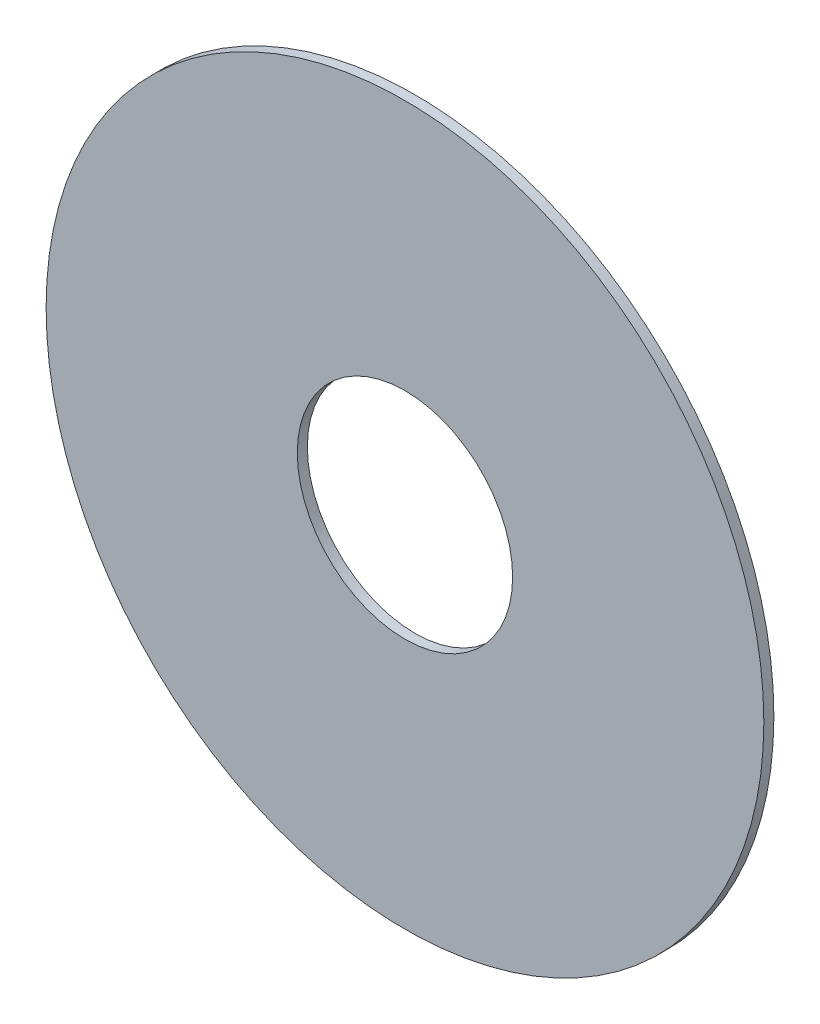
ISO-10303-21;
HEADER;
FILE_DESCRIPTION(('STEP AP214'),'2;1');
FILE_NAME('part.step','',(''),(''),'','','');
FILE_SCHEMA(('AUTOMOTIVE_DESIGN { 1 0 10303 214 1 1 1 1 }'));
ENDSEC;
DATA;
#1=APPLICATION_CONTEXT('core data for automotive mechanical design processes');
#2=APPLICATION_PROTOCOL_DEFINITION('international standard','automotive_design',2000,#1);
#3=PRODUCT_CONTEXT('',#1,'mechanical');
#4=PRODUCT('Part','Part','',(#3));
#5=PRODUCT_RELATED_PRODUCT_CATEGORY('part','',(#4));
#6=PRODUCT_DEFINITION_FORMATION('','',#4);
#7=PRODUCT_DEFINITION_CONTEXT('part definition',#1,'design');
#8=PRODUCT_DEFINITION('design','',#6,#7);
#9=PRODUCT_DEFINITION_SHAPE('','',#8);
#10=(LENGTH_UNIT() NAMED_UNIT(*) SI_UNIT(.MILLI.,.METRE.));
#11=(NAMED_UNIT(*) PLANE_ANGLE_UNIT() SI_UNIT($,.RADIAN.));
#12=(NAMED_UNIT(*) SI_UNIT($,.STERADIAN.) SOLID_ANGLE_UNIT());
#13=UNCERTAINTY_MEASURE_WITH_UNIT(LENGTH_MEASURE(1.E-05),#10,'distance_accuracy_value','');
#14=(GEOMETRIC_REPRESENTATION_CONTEXT(3) GLOBAL_UNCERTAINTY_ASSIGNED_CONTEXT((#13)) GLOBAL_UNIT_ASSIGNED_CONTEXT((#10,
#11,#12)) REPRESENTATION_CONTEXT('',''));
#15=CARTESIAN_POINT('',(0.,0.,0.));
#16=DIRECTION('',(0.,0.,1.));
#17=DIRECTION('',(1.,0.,0.));
#18=AXIS2_PLACEMENT_3D('',#15,#16,#17);
#19=CARTESIAN_POINT('',(170.18,-110.236,-0.045));
#20=DIRECTION('',(0.,0.,-1.));
#21=DIRECTION('',(0.,-1.,0.));
#22=AXIS2_PLACEMENT_3D('',#19,#20,#21);
#23=CYLINDRICAL_SURFACE('',#22,0.375);
#24=CARTESIAN_POINT('',(170.18,-110.236,-0.035));
#25=DIRECTION('',(0.,0.,-1.));
#26=DIRECTION('',(0.,-1.,0.));
#27=AXIS2_PLACEMENT_3D('',#24,#25,#26);
#28=CIRCLE('',#27,0.375);
#29=CARTESIAN_POINT('',(170.18,-110.611,-0.035));
#30=VERTEX_POINT('',#29);
#31=EDGE_CURVE('E25',#30,#30,#28,.T.);
#32=ORIENTED_EDGE('',*,*,#31,.T.);
#33=DIRECTION('',(0.,0.,1.));
#34=VECTOR('',#33,1.);
#35=CARTESIAN_POINT('',(170.18,-110.611,-0.045));
#36=LINE('',#35,#34);
#37=CARTESIAN_POINT('',(170.18,-110.611,0.));
#38=VERTEX_POINT('',#37);
#39=EDGE_CURVE('E11',#30,#38,#36,.T.);
#40=ORIENTED_EDGE('',*,*,#39,.T.);
#41=CARTESIAN_POINT('',(170.18,-110.236,0.));
#42=DIRECTION('',(0.,0.,-1.));
#43=DIRECTION('',(0.,-1.,0.));
#44=AXIS2_PLACEMENT_3D('',#41,#42,#43);
#45=CIRCLE('',#44,0.375);
#46=EDGE_CURVE('E69',#38,#38,#45,.T.);
#47=ORIENTED_EDGE('',*,*,#46,.F.);
#48=ORIENTED_EDGE('',*,*,#39,.F.);
#49=EDGE_LOOP('',(#32,#40,#47,#48));
#50=FACE_BOUND('',#49,.T.);
#51=ADVANCED_FACE('F17',(#50),#23,.F.);
#52=CARTESIAN_POINT('',(170.18,-110.236,-0.035));
#53=DIRECTION('',(0.,0.,1.));
#54=DIRECTION('',(1.,0.,0.));
#55=AXIS2_PLACEMENT_3D('',#52,#53,#54);
#56=PLANE('',#55);
#57=ORIENTED_EDGE('',*,*,#31,.F.);
#58=EDGE_LOOP('',(#57));
#59=FACE_BOUND('',#58,.T.);
#60=CARTESIAN_POINT('',(170.18,-110.236,-0.035));
#61=DIRECTION('',(0.,0.,1.));
#62=DIRECTION('',(1.,0.,0.));
#63=AXIS2_PLACEMENT_3D('',#60,#61,#62);
#64=CIRCLE('',#63,1.25);
#65=CARTESIAN_POINT('',(171.43,-110.236,-0.035));
#66=VERTEX_POINT('',#65);
#67=EDGE_CURVE('E56',#66,#66,#64,.T.);
#68=ORIENTED_EDGE('',*,*,#67,.F.);
#69=EDGE_LOOP('',(#68));
#70=FACE_BOUND('',#69,.T.);
#71=ADVANCED_FACE('F76',(#59,#70),#56,.F.);
#72=CARTESIAN_POINT('',(170.18,-110.236,0.));
#73=DIRECTION('',(0.,0.,1.));
#74=DIRECTION('',(1.,0.,0.));
#75=AXIS2_PLACEMENT_3D('',#72,#73,#74);
#76=PLANE('',#75);
#77=ORIENTED_EDGE('',*,*,#46,.T.);
#78=EDGE_LOOP('',(#77));
#79=FACE_BOUND('',#78,.T.);
#80=CARTESIAN_POINT('',(170.18,-110.236,0.));
#81=DIRECTION('',(0.,0.,1.));
#82=DIRECTION('',(1.,0.,0.));
#83=AXIS2_PLACEMENT_3D('',#80,#81,#82);
#84=CIRCLE('',#83,1.25);
#85=CARTESIAN_POINT('',(171.43,-110.236,0.));
#86=VERTEX_POINT('',#85);
#87=EDGE_CURVE('E54',#86,#86,#84,.T.);
#88=ORIENTED_EDGE('',*,*,#87,.T.);
#89=EDGE_LOOP('',(#88));
#90=FACE_BOUND('',#89,.T.);
#91=ADVANCED_FACE('F60',(#79,#90),#76,.T.);
#92=CARTESIAN_POINT('',(170.18,-110.236,-0.035));
#93=DIRECTION('',(0.,0.,1.));
#94=DIRECTION('',(1.,0.,0.));
#95=AXIS2_PLACEMENT_3D('',#92,#93,#94);
#96=CYLINDRICAL_SURFACE('',#95,1.25);
#97=ORIENTED_EDGE('',*,*,#87,.F.);
#98=DIRECTION('',(0.,0.,1.));
#99=VECTOR('',#98,1.);
#100=CARTESIAN_POINT('',(171.43,-110.236,-0.035));
#101=LINE('',#100,#99);
#102=EDGE_CURVE('E51',#66,#86,#101,.T.);
#103=ORIENTED_EDGE('',*,*,#102,.F.);
#104=ORIENTED_EDGE('',*,*,#67,.T.);
#105=ORIENTED_EDGE('',*,*,#102,.T.);
#106=EDGE_LOOP('',(#97,#103,#104,#105));
#107=FACE_BOUND('',#106,.T.);
#108=ADVANCED_FACE('F53',(#107),#96,.T.);
#109=CLOSED_SHELL('',(#51,#71,#91,#108));
#110=MANIFOLD_SOLID_BREP('B1',#109);
#111=ADVANCED_BREP_SHAPE_REPRESENTATION('',(#18,#110),#14);
#112=SHAPE_DEFINITION_REPRESENTATION(#9,#111);
ENDSEC;
END-ISO-10303-21;
